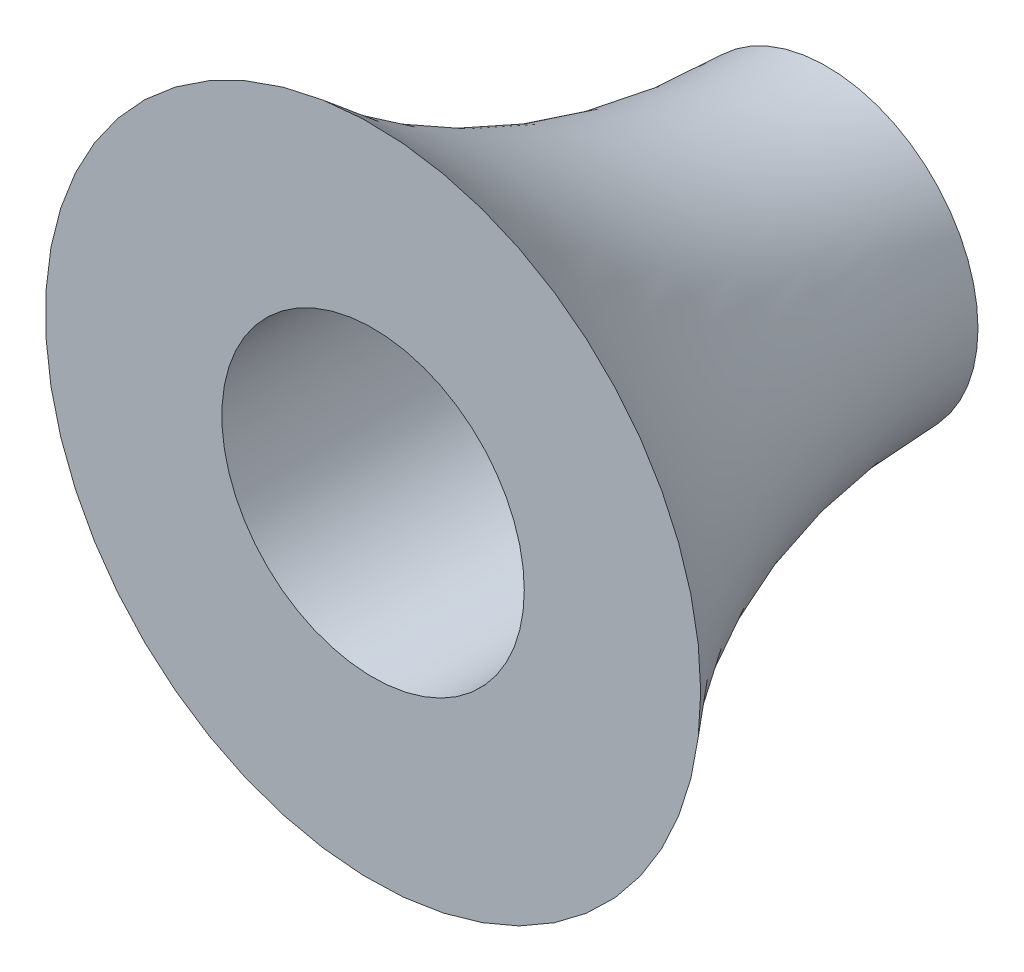
ISO-10303-21;
HEADER;
FILE_DESCRIPTION(('STEP AP214'),'2;1');
FILE_NAME('part.step','',(''),(''),'','','');
FILE_SCHEMA(('AUTOMOTIVE_DESIGN { 1 0 10303 214 1 1 1 1 }'));
ENDSEC;
DATA;
#1=APPLICATION_CONTEXT('core data for automotive mechanical design processes');
#2=APPLICATION_PROTOCOL_DEFINITION('international standard','automotive_design',2000,#1);
#3=PRODUCT_CONTEXT('',#1,'mechanical');
#4=PRODUCT('Part','Part','',(#3));
#5=PRODUCT_RELATED_PRODUCT_CATEGORY('part','',(#4));
#6=PRODUCT_DEFINITION_FORMATION('','',#4);
#7=PRODUCT_DEFINITION_CONTEXT('part definition',#1,'design');
#8=PRODUCT_DEFINITION('design','',#6,#7);
#9=PRODUCT_DEFINITION_SHAPE('','',#8);
#10=(LENGTH_UNIT() NAMED_UNIT(*) SI_UNIT(.MILLI.,.METRE.));
#11=(NAMED_UNIT(*) PLANE_ANGLE_UNIT() SI_UNIT($,.RADIAN.));
#12=(NAMED_UNIT(*) SI_UNIT($,.STERADIAN.) SOLID_ANGLE_UNIT());
#13=UNCERTAINTY_MEASURE_WITH_UNIT(LENGTH_MEASURE(1.E-05),#10,'distance_accuracy_value','');
#14=(GEOMETRIC_REPRESENTATION_CONTEXT(3) GLOBAL_UNCERTAINTY_ASSIGNED_CONTEXT((#13)) GLOBAL_UNIT_ASSIGNED_CONTEXT((#10,
#11,#12)) REPRESENTATION_CONTEXT('',''));
#15=CARTESIAN_POINT('',(0.,0.,0.));
#16=DIRECTION('',(0.,0.,1.));
#17=DIRECTION('',(1.,0.,0.));
#18=AXIS2_PLACEMENT_3D('',#15,#16,#17);
#19=CARTESIAN_POINT('',(2.79194473467972,-5.08305526532028,-7.02));
#20=DIRECTION('',(0.,0.,1.));
#21=DIRECTION('',(1.,0.,0.));
#22=AXIS2_PLACEMENT_3D('',#19,#20,#21);
#23=PLANE('',#22);
#24=CARTESIAN_POINT('',(3.675,-4.2,-7.02));
#25=DIRECTION('',(0.,0.,1.));
#26=DIRECTION('',(1.,0.,0.));
#27=AXIS2_PLACEMENT_3D('',#24,#25,#26);
#28=CIRCLE('',#27,0.299999999999999);
#29=CARTESIAN_POINT('',(3.975,-4.2,-7.02));
#30=VERTEX_POINT('',#29);
#31=EDGE_CURVE('E19',#30,#30,#28,.T.);
#32=ORIENTED_EDGE('',*,*,#31,.F.);
#33=EDGE_LOOP('',(#32));
#34=FACE_BOUND('',#33,.T.);
#35=CARTESIAN_POINT('',(3.675,-4.2,-7.01999999999981));
#36=DIRECTION('',(0.,0.,1.));
#37=DIRECTION('',(1.,0.,0.));
#38=AXIS2_PLACEMENT_3D('',#35,#36,#37);
#39=CIRCLE('',#38,0.650000000001198);
#40=CARTESIAN_POINT('',(4.3250000000012,-4.2,-7.01999999999981));
#41=VERTEX_POINT('',#40);
#42=EDGE_CURVE('E23',#41,#41,#39,.F.);
#43=ORIENTED_EDGE('',*,*,#42,.F.);
#44=EDGE_LOOP('',(#43));
#45=FACE_BOUND('',#44,.T.);
#46=ADVANCED_FACE('F15',(#34,#45),#23,.T.);
#47=CARTESIAN_POINT('',(3.675,-4.2,-7.92));
#48=DIRECTION('',(0.,0.,1.));
#49=DIRECTION('',(1.,0.,0.));
#50=AXIS2_PLACEMENT_3D('',#47,#48,#49);
#51=CYLINDRICAL_SURFACE('',#50,0.299999999999999);
#52=ORIENTED_EDGE('',*,*,#31,.T.);
#53=EDGE_LOOP('',(#52));
#54=FACE_BOUND('',#53,.T.);
#55=CARTESIAN_POINT('',(3.675,-4.2,-7.92));
#56=DIRECTION('',(0.,0.,1.));
#57=DIRECTION('',(1.,0.,0.));
#58=AXIS2_PLACEMENT_3D('',#55,#56,#57);
#59=CIRCLE('',#58,0.299999999999999);
#60=CARTESIAN_POINT('',(3.975,-4.2,-7.92));
#61=VERTEX_POINT('',#60);
#62=EDGE_CURVE('E10',#61,#61,#59,.T.);
#63=ORIENTED_EDGE('',*,*,#62,.F.);
#64=EDGE_LOOP('',(#63));
#65=FACE_BOUND('',#64,.T.);
#66=ADVANCED_FACE('F33',(#54,#65),#51,.F.);
#67=CARTESIAN_POINT('',(3.675,-4.2,-7.92));
#68=DIRECTION('',(0.,0.,1.));
#69=DIRECTION('',(1.,0.,0.));
#70=AXIS2_PLACEMENT_3D('',#67,#68,#69);
#71=TOROIDAL_SURFACE('',#70,1.63214285713999,1.33214285713999);
#72=ORIENTED_EDGE('',*,*,#62,.T.);
#73=EDGE_LOOP('',(#72));
#74=FACE_BOUND('',#73,.T.);
#75=ORIENTED_EDGE('',*,*,#42,.T.);
#76=EDGE_LOOP('',(#75));
#77=FACE_BOUND('',#76,.T.);
#78=ADVANCED_FACE('F17',(#74,#77),#71,.F.);
#79=CLOSED_SHELL('',(#46,#66,#78));
#80=MANIFOLD_SOLID_BREP('B1',#79);
#81=ADVANCED_BREP_SHAPE_REPRESENTATION('',(#18,#80),#14);
#82=SHAPE_DEFINITION_REPRESENTATION(#9,#81);
ENDSEC;
END-ISO-10303-21;
